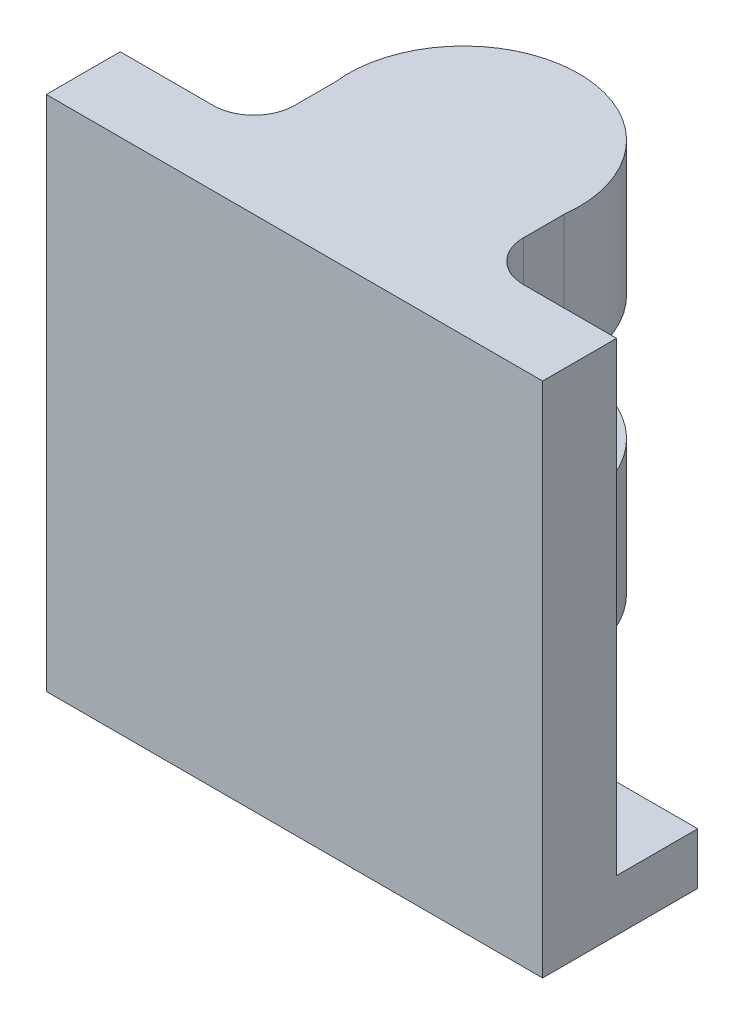
ISO-10303-21;
HEADER;
FILE_DESCRIPTION(('STEP AP214'),'2;1');
FILE_NAME('part.step','',(''),(''),'','','');
FILE_SCHEMA(('AUTOMOTIVE_DESIGN { 1 0 10303 214 1 1 1 1 }'));
ENDSEC;
DATA;
#1=APPLICATION_CONTEXT('core data for automotive mechanical design processes');
#2=APPLICATION_PROTOCOL_DEFINITION('international standard','automotive_design',2000,#1);
#3=PRODUCT_CONTEXT('',#1,'mechanical');
#4=PRODUCT('Part','Part','',(#3));
#5=PRODUCT_RELATED_PRODUCT_CATEGORY('part','',(#4));
#6=PRODUCT_DEFINITION_FORMATION('','',#4);
#7=PRODUCT_DEFINITION_CONTEXT('part definition',#1,'design');
#8=PRODUCT_DEFINITION('design','',#6,#7);
#9=PRODUCT_DEFINITION_SHAPE('','',#8);
#10=(LENGTH_UNIT() NAMED_UNIT(*) SI_UNIT(.MILLI.,.METRE.));
#11=(NAMED_UNIT(*) PLANE_ANGLE_UNIT() SI_UNIT($,.RADIAN.));
#12=(NAMED_UNIT(*) SI_UNIT($,.STERADIAN.) SOLID_ANGLE_UNIT());
#13=UNCERTAINTY_MEASURE_WITH_UNIT(LENGTH_MEASURE(1.E-05),#10,'distance_accuracy_value','');
#14=(GEOMETRIC_REPRESENTATION_CONTEXT(3) GLOBAL_UNCERTAINTY_ASSIGNED_CONTEXT((#13)) GLOBAL_UNIT_ASSIGNED_CONTEXT((#10,
#11,#12)) REPRESENTATION_CONTEXT('',''));
#15=CARTESIAN_POINT('',(0.,0.,0.));
#16=DIRECTION('',(0.,0.,1.));
#17=DIRECTION('',(1.,0.,0.));
#18=AXIS2_PLACEMENT_3D('',#15,#16,#17);
#19=CARTESIAN_POINT('',(-48.,10.,-134.85));
#20=DIRECTION('',(0.,0.,1.));
#21=DIRECTION('',(1.,0.,0.));
#22=AXIS2_PLACEMENT_3D('',#19,#20,#21);
#23=PLANE('',#22);
#24=DIRECTION('',(-1.,0.,0.));
#25=VECTOR('',#24,1.);
#26=CARTESIAN_POINT('',(-48.,24.,-134.85));
#27=LINE('',#26,#25);
#28=CARTESIAN_POINT('',(22.15,24.,-134.85));
#29=VERTEX_POINT('',#28);
#30=CARTESIAN_POINT('',(-22.15,24.,-134.85));
#31=VERTEX_POINT('',#30);
#32=EDGE_CURVE('E167',#29,#31,#27,.T.);
#33=ORIENTED_EDGE('',*,*,#32,.F.);
#34=DIRECTION('',(0.,-1.,0.));
#35=VECTOR('',#34,1.);
#36=CARTESIAN_POINT('',(22.15,100.,-134.85));
#37=LINE('',#36,#35);
#38=CARTESIAN_POINT('',(22.15,9.99999999999999,-134.85));
#39=VERTEX_POINT('',#38);
#40=EDGE_CURVE('E172',#29,#39,#37,.T.);
#41=ORIENTED_EDGE('',*,*,#40,.T.);
#42=DIRECTION('',(-1.,0.,0.));
#43=VECTOR('',#42,1.);
#44=CARTESIAN_POINT('',(-48.,10.,-134.85));
#45=LINE('',#44,#43);
#46=CARTESIAN_POINT('',(48.,10.,-134.85));
#47=VERTEX_POINT('',#46);
#48=EDGE_CURVE('E238',#47,#39,#45,.T.);
#49=ORIENTED_EDGE('',*,*,#48,.F.);
#50=DIRECTION('',(0.,-1.,0.));
#51=VECTOR('',#50,1.);
#52=CARTESIAN_POINT('',(48.,10.,-134.85));
#53=LINE('',#52,#51);
#54=CARTESIAN_POINT('',(48.,0.,-134.85));
#55=VERTEX_POINT('',#54);
#56=EDGE_CURVE('E249',#47,#55,#53,.T.);
#57=ORIENTED_EDGE('',*,*,#56,.T.);
#58=DIRECTION('',(-1.,0.,0.));
#59=VECTOR('',#58,1.);
#60=CARTESIAN_POINT('',(-48.,0.,-134.85));
#61=LINE('',#60,#59);
#62=CARTESIAN_POINT('',(-48.,0.,-134.85));
#63=VERTEX_POINT('',#62);
#64=EDGE_CURVE('E235',#55,#63,#61,.T.);
#65=ORIENTED_EDGE('',*,*,#64,.T.);
#66=DIRECTION('',(0.,-1.,0.));
#67=VECTOR('',#66,1.);
#68=CARTESIAN_POINT('',(-48.,10.,-134.85));
#69=LINE('',#68,#67);
#70=CARTESIAN_POINT('',(-48.,10.,-134.85));
#71=VERTEX_POINT('',#70);
#72=EDGE_CURVE('E240',#71,#63,#69,.T.);
#73=ORIENTED_EDGE('',*,*,#72,.F.);
#74=CARTESIAN_POINT('',(-22.15,9.99999999999999,-134.85));
#75=VERTEX_POINT('',#74);
#76=EDGE_CURVE('E237',#75,#71,#45,.T.);
#77=ORIENTED_EDGE('',*,*,#76,.F.);
#78=DIRECTION('',(0.,-1.,0.));
#79=VECTOR('',#78,1.);
#80=CARTESIAN_POINT('',(-22.15,100.,-134.85));
#81=LINE('',#80,#79);
#82=EDGE_CURVE('E175',#31,#75,#81,.T.);
#83=ORIENTED_EDGE('',*,*,#82,.F.);
#84=EDGE_LOOP('',(#33,#41,#49,#57,#65,#73,#77,#83));
#85=FACE_BOUND('',#84,.T.);
#86=ADVANCED_FACE('F47',(#85),#23,.F.);
#87=CARTESIAN_POINT('',(22.15,74.,-134.85));
#88=VERTEX_POINT('',#87);
#89=CARTESIAN_POINT('',(22.15,50.,-134.85));
#90=VERTEX_POINT('',#89);
#91=EDGE_CURVE('E183',#88,#90,#37,.T.);
#92=ORIENTED_EDGE('',*,*,#91,.T.);
#93=DIRECTION('',(-1.,0.,0.));
#94=VECTOR('',#93,1.);
#95=CARTESIAN_POINT('',(-48.,50.,-134.85));
#96=LINE('',#95,#94);
#97=CARTESIAN_POINT('',(-22.15,50.,-134.85));
#98=VERTEX_POINT('',#97);
#99=EDGE_CURVE('E161',#90,#98,#96,.T.);
#100=ORIENTED_EDGE('',*,*,#99,.T.);
#101=CARTESIAN_POINT('',(-22.15,74.,-134.85));
#102=VERTEX_POINT('',#101);
#103=EDGE_CURVE('E188',#102,#98,#81,.T.);
#104=ORIENTED_EDGE('',*,*,#103,.F.);
#105=DIRECTION('',(-1.,0.,0.));
#106=VECTOR('',#105,1.);
#107=CARTESIAN_POINT('',(-48.,74.,-134.85));
#108=LINE('',#107,#106);
#109=EDGE_CURVE('E310',#88,#102,#108,.T.);
#110=ORIENTED_EDGE('',*,*,#109,.F.);
#111=EDGE_LOOP('',(#92,#100,#104,#110));
#112=FACE_BOUND('',#111,.T.);
#113=ADVANCED_FACE('F322',(#112),#23,.F.);
#114=CARTESIAN_POINT('',(0.,10.,0.));
#115=DIRECTION('',(0.,1.,0.));
#116=DIRECTION('',(0.,0.,1.));
#117=AXIS2_PLACEMENT_3D('',#114,#115,#116);
#118=PLANE('',#117);
#119=CARTESIAN_POINT('',(30.,10.,-127.));
#120=DIRECTION('',(0.,1.,0.));
#121=DIRECTION('',(0.,0.,1.));
#122=AXIS2_PLACEMENT_3D('',#119,#120,#121);
#123=CIRCLE('',#122,1.5);
#124=CARTESIAN_POINT('',(30.,10.,-125.5));
#125=VERTEX_POINT('',#124);
#126=EDGE_CURVE('E219',#125,#125,#123,.T.);
#127=ORIENTED_EDGE('',*,*,#126,.F.);
#128=EDGE_LOOP('',(#127));
#129=FACE_BOUND('',#128,.T.);
#130=CARTESIAN_POINT('',(30.,9.99999999999999,-127.));
#131=DIRECTION('',(0.,1.,0.));
#132=DIRECTION('',(0.,0.,1.));
#133=AXIS2_PLACEMENT_3D('',#130,#131,#132);
#134=CIRCLE('',#133,7.85);
#135=CARTESIAN_POINT('',(22.15,9.99999999999999,-127.));
#136=VERTEX_POINT('',#135);
#137=CARTESIAN_POINT('',(30.,9.99999999999999,-119.15));
#138=VERTEX_POINT('',#137);
#139=EDGE_CURVE('E215',#136,#138,#134,.T.);
#140=ORIENTED_EDGE('',*,*,#139,.T.);
#141=DIRECTION('',(1.,0.,0.));
#142=VECTOR('',#141,1.);
#143=CARTESIAN_POINT('',(0.,10.,-119.15));
#144=LINE('',#143,#142);
#145=CARTESIAN_POINT('',(48.,9.99999999999999,-119.15));
#146=VERTEX_POINT('',#145);
#147=EDGE_CURVE('E206',#138,#146,#144,.T.);
#148=ORIENTED_EDGE('',*,*,#147,.T.);
#149=DIRECTION('',(0.,0.,-1.));
#150=VECTOR('',#149,1.);
#151=CARTESIAN_POINT('',(48.,10.,-134.85));
#152=LINE('',#151,#150);
#153=EDGE_CURVE('E234',#146,#47,#152,.T.);
#154=ORIENTED_EDGE('',*,*,#153,.T.);
#155=ORIENTED_EDGE('',*,*,#48,.T.);
#156=DIRECTION('',(0.,0.,1.));
#157=VECTOR('',#156,1.);
#158=CARTESIAN_POINT('',(22.15,10.,0.));
#159=LINE('',#158,#157);
#160=EDGE_CURVE('E181',#39,#136,#159,.T.);
#161=ORIENTED_EDGE('',*,*,#160,.T.);
#162=EDGE_LOOP('',(#140,#148,#154,#155,#161));
#163=FACE_BOUND('',#162,.T.);
#164=ADVANCED_FACE('F333',(#129,#163),#118,.T.);
#165=CARTESIAN_POINT('',(-30.,10.,-127.));
#166=DIRECTION('',(0.,1.,0.));
#167=DIRECTION('',(0.,0.,1.));
#168=AXIS2_PLACEMENT_3D('',#165,#166,#167);
#169=CIRCLE('',#168,1.5);
#170=CARTESIAN_POINT('',(-30.,10.,-125.5));
#171=VERTEX_POINT('',#170);
#172=EDGE_CURVE('E225',#171,#171,#169,.T.);
#173=ORIENTED_EDGE('',*,*,#172,.F.);
#174=EDGE_LOOP('',(#173));
#175=FACE_BOUND('',#174,.T.);
#176=CARTESIAN_POINT('',(-30.,9.99999999999999,-127.));
#177=DIRECTION('',(0.,1.,0.));
#178=DIRECTION('',(0.,0.,1.));
#179=AXIS2_PLACEMENT_3D('',#176,#177,#178);
#180=CIRCLE('',#179,7.85);
#181=CARTESIAN_POINT('',(-30.,10.,-119.15));
#182=VERTEX_POINT('',#181);
#183=CARTESIAN_POINT('',(-22.15,9.99999999999999,-127.));
#184=VERTEX_POINT('',#183);
#185=EDGE_CURVE('E212',#182,#184,#180,.T.);
#186=ORIENTED_EDGE('',*,*,#185,.T.);
#187=DIRECTION('',(0.,0.,-1.));
#188=VECTOR('',#187,1.);
#189=CARTESIAN_POINT('',(-22.15,10.,0.));
#190=LINE('',#189,#188);
#191=EDGE_CURVE('E202',#184,#75,#190,.T.);
#192=ORIENTED_EDGE('',*,*,#191,.T.);
#193=ORIENTED_EDGE('',*,*,#76,.T.);
#194=DIRECTION('',(0.,0.,1.));
#195=VECTOR('',#194,1.);
#196=CARTESIAN_POINT('',(-48.,10.,-134.85));
#197=LINE('',#196,#195);
#198=CARTESIAN_POINT('',(-48.,9.99999999999999,-119.15));
#199=VERTEX_POINT('',#198);
#200=EDGE_CURVE('E231',#71,#199,#197,.T.);
#201=ORIENTED_EDGE('',*,*,#200,.T.);
#202=DIRECTION('',(1.,0.,0.));
#203=VECTOR('',#202,1.);
#204=CARTESIAN_POINT('',(0.,10.,-119.15));
#205=LINE('',#204,#203);
#206=EDGE_CURVE('E209',#199,#182,#205,.T.);
#207=ORIENTED_EDGE('',*,*,#206,.T.);
#208=EDGE_LOOP('',(#186,#192,#193,#201,#207));
#209=FACE_BOUND('',#208,.T.);
#210=ADVANCED_FACE('F276',(#175,#209),#118,.T.);
#211=CARTESIAN_POINT('',(0.,0.,0.));
#212=DIRECTION('',(0.,1.,0.));
#213=DIRECTION('',(0.,0.,1.));
#214=AXIS2_PLACEMENT_3D('',#211,#212,#213);
#215=PLANE('',#214);
#216=ORIENTED_EDGE('',*,*,#64,.F.);
#217=DIRECTION('',(0.,0.,-1.));
#218=VECTOR('',#217,1.);
#219=CARTESIAN_POINT('',(48.,0.,-134.85));
#220=LINE('',#219,#218);
#221=CARTESIAN_POINT('',(48.,0.,-104.85));
#222=VERTEX_POINT('',#221);
#223=EDGE_CURVE('E244',#222,#55,#220,.T.);
#224=ORIENTED_EDGE('',*,*,#223,.F.);
#225=DIRECTION('',(1.,0.,0.));
#226=VECTOR('',#225,1.);
#227=CARTESIAN_POINT('',(-48.,0.,-104.85));
#228=LINE('',#227,#226);
#229=CARTESIAN_POINT('',(-48.,0.,-104.85));
#230=VERTEX_POINT('',#229);
#231=EDGE_CURVE('E242',#230,#222,#228,.T.);
#232=ORIENTED_EDGE('',*,*,#231,.F.);
#233=DIRECTION('',(0.,0.,1.));
#234=VECTOR('',#233,1.);
#235=CARTESIAN_POINT('',(-48.,0.,-134.85));
#236=LINE('',#235,#234);
#237=EDGE_CURVE('E228',#63,#230,#236,.T.);
#238=ORIENTED_EDGE('',*,*,#237,.F.);
#239=EDGE_LOOP('',(#216,#224,#232,#238));
#240=FACE_BOUND('',#239,.T.);
#241=CARTESIAN_POINT('',(-30.,0.,-127.));
#242=DIRECTION('',(0.,1.,0.));
#243=DIRECTION('',(0.,0.,1.));
#244=AXIS2_PLACEMENT_3D('',#241,#242,#243);
#245=CIRCLE('',#244,1.5);
#246=CARTESIAN_POINT('',(-30.,0.,-125.5));
#247=VERTEX_POINT('',#246);
#248=EDGE_CURVE('E222',#247,#247,#245,.T.);
#249=ORIENTED_EDGE('',*,*,#248,.T.);
#250=EDGE_LOOP('',(#249));
#251=FACE_BOUND('',#250,.T.);
#252=CARTESIAN_POINT('',(30.,0.,-127.));
#253=DIRECTION('',(0.,1.,0.));
#254=DIRECTION('',(0.,0.,1.));
#255=AXIS2_PLACEMENT_3D('',#252,#253,#254);
#256=CIRCLE('',#255,1.5);
#257=CARTESIAN_POINT('',(30.,0.,-125.5));
#258=VERTEX_POINT('',#257);
#259=EDGE_CURVE('E218',#258,#258,#256,.T.);
#260=ORIENTED_EDGE('',*,*,#259,.T.);
#261=EDGE_LOOP('',(#260));
#262=FACE_BOUND('',#261,.T.);
#263=ADVANCED_FACE('F265',(#240,#251,#262),#215,.F.);
#264=CARTESIAN_POINT('',(-48.,10.,-134.85));
#265=DIRECTION('',(1.,0.,0.));
#266=DIRECTION('',(0.,0.,-1.));
#267=AXIS2_PLACEMENT_3D('',#264,#265,#266);
#268=PLANE('',#267);
#269=DIRECTION('',(0.,-1.,0.));
#270=VECTOR('',#269,1.);
#271=CARTESIAN_POINT('',(-48.,10.,-104.85));
#272=LINE('',#271,#270);
#273=CARTESIAN_POINT('',(-48.,100.,-104.85));
#274=VERTEX_POINT('',#273);
#275=EDGE_CURVE('E13',#274,#230,#272,.T.);
#276=ORIENTED_EDGE('',*,*,#275,.F.);
#277=DIRECTION('',(0.,0.,1.));
#278=VECTOR('',#277,1.);
#279=CARTESIAN_POINT('',(-48.,100.,-119.15));
#280=LINE('',#279,#278);
#281=CARTESIAN_POINT('',(-48.,100.,-119.15));
#282=VERTEX_POINT('',#281);
#283=EDGE_CURVE('E307',#282,#274,#280,.T.);
#284=ORIENTED_EDGE('',*,*,#283,.F.);
#285=DIRECTION('',(0.,-1.,0.));
#286=VECTOR('',#285,1.);
#287=CARTESIAN_POINT('',(-48.,100.,-119.15));
#288=LINE('',#287,#286);
#289=EDGE_CURVE('E274',#282,#199,#288,.T.);
#290=ORIENTED_EDGE('',*,*,#289,.T.);
#291=ORIENTED_EDGE('',*,*,#200,.F.);
#292=ORIENTED_EDGE('',*,*,#72,.T.);
#293=ORIENTED_EDGE('',*,*,#237,.T.);
#294=EDGE_LOOP('',(#276,#284,#290,#291,#292,#293));
#295=FACE_BOUND('',#294,.T.);
#296=ADVANCED_FACE('F49',(#295),#268,.F.);
#297=CARTESIAN_POINT('',(-48.,10.,-104.85));
#298=DIRECTION('',(0.,0.,-1.));
#299=DIRECTION('',(-1.,0.,0.));
#300=AXIS2_PLACEMENT_3D('',#297,#298,#299);
#301=PLANE('',#300);
#302=DIRECTION('',(0.,-1.,0.));
#303=VECTOR('',#302,1.);
#304=CARTESIAN_POINT('',(48.,10.,-104.85));
#305=LINE('',#304,#303);
#306=CARTESIAN_POINT('',(48.,100.,-104.85));
#307=VERTEX_POINT('',#306);
#308=EDGE_CURVE('E55',#307,#222,#305,.T.);
#309=ORIENTED_EDGE('',*,*,#308,.F.);
#310=DIRECTION('',(1.,0.,0.));
#311=VECTOR('',#310,1.);
#312=CARTESIAN_POINT('',(48.,100.,-104.85));
#313=LINE('',#312,#311);
#314=EDGE_CURVE('E305',#274,#307,#313,.T.);
#315=ORIENTED_EDGE('',*,*,#314,.F.);
#316=ORIENTED_EDGE('',*,*,#275,.T.);
#317=ORIENTED_EDGE('',*,*,#231,.T.);
#318=EDGE_LOOP('',(#309,#315,#316,#317));
#319=FACE_BOUND('',#318,.T.);
#320=ADVANCED_FACE('F357',(#319),#301,.F.);
#321=CARTESIAN_POINT('',(48.,10.,-134.85));
#322=DIRECTION('',(-1.,0.,0.));
#323=DIRECTION('',(0.,0.,1.));
#324=AXIS2_PLACEMENT_3D('',#321,#322,#323);
#325=PLANE('',#324);
#326=ORIENTED_EDGE('',*,*,#223,.T.);
#327=ORIENTED_EDGE('',*,*,#56,.F.);
#328=ORIENTED_EDGE('',*,*,#153,.F.);
#329=DIRECTION('',(0.,-1.,0.));
#330=VECTOR('',#329,1.);
#331=CARTESIAN_POINT('',(48.,100.,-119.15));
#332=LINE('',#331,#330);
#333=CARTESIAN_POINT('',(48.,100.,-119.15));
#334=VERTEX_POINT('',#333);
#335=EDGE_CURVE('E198',#334,#146,#332,.T.);
#336=ORIENTED_EDGE('',*,*,#335,.F.);
#337=DIRECTION('',(0.,0.,-1.));
#338=VECTOR('',#337,1.);
#339=CARTESIAN_POINT('',(48.,100.,-119.15));
#340=LINE('',#339,#338);
#341=EDGE_CURVE('E259',#307,#334,#340,.T.);
#342=ORIENTED_EDGE('',*,*,#341,.F.);
#343=ORIENTED_EDGE('',*,*,#308,.T.);
#344=EDGE_LOOP('',(#326,#327,#328,#336,#342,#343));
#345=FACE_BOUND('',#344,.T.);
#346=ADVANCED_FACE('F256',(#345),#325,.F.);
#347=CARTESIAN_POINT('',(-30.,10.,-127.));
#348=DIRECTION('',(0.,-1.,0.));
#349=DIRECTION('',(0.,0.,-1.));
#350=AXIS2_PLACEMENT_3D('',#347,#348,#349);
#351=CYLINDRICAL_SURFACE('',#350,1.5);
#352=ORIENTED_EDGE('',*,*,#172,.T.);
#353=EDGE_LOOP('',(#352));
#354=FACE_BOUND('',#353,.T.);
#355=ORIENTED_EDGE('',*,*,#248,.F.);
#356=EDGE_LOOP('',(#355));
#357=FACE_BOUND('',#356,.T.);
#358=ADVANCED_FACE('F345',(#354,#357),#351,.F.);
#359=CARTESIAN_POINT('',(30.,10.,-127.));
#360=DIRECTION('',(0.,-1.,0.));
#361=DIRECTION('',(0.,0.,-1.));
#362=AXIS2_PLACEMENT_3D('',#359,#360,#361);
#363=CYLINDRICAL_SURFACE('',#362,1.5);
#364=ORIENTED_EDGE('',*,*,#126,.T.);
#365=EDGE_LOOP('',(#364));
#366=FACE_BOUND('',#365,.T.);
#367=ORIENTED_EDGE('',*,*,#259,.F.);
#368=EDGE_LOOP('',(#367));
#369=FACE_BOUND('',#368,.T.);
#370=ADVANCED_FACE('F338',(#366,#369),#363,.F.);
#371=CARTESIAN_POINT('',(30.,100.,-119.15));
#372=DIRECTION('',(0.,0.,1.));
#373=DIRECTION('',(1.,0.,0.));
#374=AXIS2_PLACEMENT_3D('',#371,#372,#373);
#375=PLANE('',#374);
#376=ORIENTED_EDGE('',*,*,#147,.F.);
#377=DIRECTION('',(0.,-1.,0.));
#378=VECTOR('',#377,1.);
#379=CARTESIAN_POINT('',(30.,100.,-119.15));
#380=LINE('',#379,#378);
#381=CARTESIAN_POINT('',(30.,100.,-119.15));
#382=VERTEX_POINT('',#381);
#383=EDGE_CURVE('E193',#382,#138,#380,.T.);
#384=ORIENTED_EDGE('',*,*,#383,.F.);
#385=DIRECTION('',(-1.,0.,0.));
#386=VECTOR('',#385,1.);
#387=CARTESIAN_POINT('',(30.,100.,-119.15));
#388=LINE('',#387,#386);
#389=EDGE_CURVE('E302',#334,#382,#388,.T.);
#390=ORIENTED_EDGE('',*,*,#389,.F.);
#391=ORIENTED_EDGE('',*,*,#335,.T.);
#392=EDGE_LOOP('',(#376,#384,#390,#391));
#393=FACE_BOUND('',#392,.T.);
#394=ADVANCED_FACE('F336',(#393),#375,.F.);
#395=CARTESIAN_POINT('',(30.,100.,-127.));
#396=DIRECTION('',(0.,-1.,0.));
#397=DIRECTION('',(0.,0.,-1.));
#398=AXIS2_PLACEMENT_3D('',#395,#396,#397);
#399=CYLINDRICAL_SURFACE('',#398,7.85);
#400=ORIENTED_EDGE('',*,*,#139,.F.);
#401=DIRECTION('',(0.,-1.,0.));
#402=VECTOR('',#401,1.);
#403=CARTESIAN_POINT('',(22.15,100.,-127.));
#404=LINE('',#403,#402);
#405=CARTESIAN_POINT('',(22.15,100.,-127.));
#406=VERTEX_POINT('',#405);
#407=EDGE_CURVE('E191',#406,#136,#404,.T.);
#408=ORIENTED_EDGE('',*,*,#407,.F.);
#409=CARTESIAN_POINT('',(30.,100.,-127.));
#410=DIRECTION('',(0.,-1.,0.));
#411=DIRECTION('',(0.,0.,1.));
#412=AXIS2_PLACEMENT_3D('',#409,#410,#411);
#413=CIRCLE('',#412,7.85);
#414=EDGE_CURVE('E300',#382,#406,#413,.T.);
#415=ORIENTED_EDGE('',*,*,#414,.F.);
#416=ORIENTED_EDGE('',*,*,#383,.T.);
#417=EDGE_LOOP('',(#400,#408,#415,#416));
#418=FACE_BOUND('',#417,.T.);
#419=ADVANCED_FACE('F331',(#418),#399,.F.);
#420=CARTESIAN_POINT('',(22.15,100.,-127.));
#421=DIRECTION('',(-1.,0.,0.));
#422=DIRECTION('',(0.,0.,1.));
#423=AXIS2_PLACEMENT_3D('',#420,#421,#422);
#424=PLANE('',#423);
#425=ORIENTED_EDGE('',*,*,#407,.T.);
#426=ORIENTED_EDGE('',*,*,#160,.F.);
#427=ORIENTED_EDGE('',*,*,#40,.F.);
#428=DIRECTION('',(0.,1.,0.));
#429=VECTOR('',#428,1.);
#430=CARTESIAN_POINT('',(22.15,24.,-134.85));
#431=LINE('',#430,#429);
#432=EDGE_CURVE('E153',#29,#90,#431,.T.);
#433=ORIENTED_EDGE('',*,*,#432,.T.);
#434=ORIENTED_EDGE('',*,*,#91,.F.);
#435=CARTESIAN_POINT('',(22.15,100.,-134.85));
#436=VERTEX_POINT('',#435);
#437=EDGE_CURVE('E186',#436,#88,#37,.T.);
#438=ORIENTED_EDGE('',*,*,#437,.F.);
#439=DIRECTION('',(0.,0.,-1.));
#440=VECTOR('',#439,1.);
#441=CARTESIAN_POINT('',(22.15,100.,-127.));
#442=LINE('',#441,#440);
#443=EDGE_CURVE('E297',#406,#436,#442,.T.);
#444=ORIENTED_EDGE('',*,*,#443,.F.);
#445=EDGE_LOOP('',(#425,#426,#427,#433,#434,#438,#444));
#446=FACE_BOUND('',#445,.T.);
#447=ADVANCED_FACE('F179',(#446),#424,.F.);
#448=CARTESIAN_POINT('',(-22.15,100.,-127.));
#449=DIRECTION('',(1.,0.,0.));
#450=DIRECTION('',(0.,0.,-1.));
#451=AXIS2_PLACEMENT_3D('',#448,#449,#450);
#452=PLANE('',#451);
#453=ORIENTED_EDGE('',*,*,#103,.T.);
#454=DIRECTION('',(0.,1.,0.));
#455=VECTOR('',#454,1.);
#456=CARTESIAN_POINT('',(-22.15,24.,-134.85));
#457=LINE('',#456,#455);
#458=EDGE_CURVE('E162',#31,#98,#457,.T.);
#459=ORIENTED_EDGE('',*,*,#458,.F.);
#460=ORIENTED_EDGE('',*,*,#82,.T.);
#461=ORIENTED_EDGE('',*,*,#191,.F.);
#462=DIRECTION('',(0.,-1.,0.));
#463=VECTOR('',#462,1.);
#464=CARTESIAN_POINT('',(-22.15,100.,-127.));
#465=LINE('',#464,#463);
#466=CARTESIAN_POINT('',(-22.15,100.,-127.));
#467=VERTEX_POINT('',#466);
#468=EDGE_CURVE('E284',#467,#184,#465,.T.);
#469=ORIENTED_EDGE('',*,*,#468,.F.);
#470=DIRECTION('',(0.,0.,1.));
#471=VECTOR('',#470,1.);
#472=CARTESIAN_POINT('',(-22.15,100.,-127.));
#473=LINE('',#472,#471);
#474=CARTESIAN_POINT('',(-22.15,100.,-134.85));
#475=VERTEX_POINT('',#474);
#476=EDGE_CURVE('E295',#475,#467,#473,.T.);
#477=ORIENTED_EDGE('',*,*,#476,.F.);
#478=EDGE_CURVE('E184',#475,#102,#81,.T.);
#479=ORIENTED_EDGE('',*,*,#478,.T.);
#480=EDGE_LOOP('',(#453,#459,#460,#461,#469,#477,#479));
#481=FACE_BOUND('',#480,.T.);
#482=ADVANCED_FACE('F282',(#481),#452,.F.);
#483=CARTESIAN_POINT('',(-30.,100.,-127.));
#484=DIRECTION('',(0.,-1.,0.));
#485=DIRECTION('',(0.,0.,-1.));
#486=AXIS2_PLACEMENT_3D('',#483,#484,#485);
#487=CYLINDRICAL_SURFACE('',#486,7.85);
#488=ORIENTED_EDGE('',*,*,#185,.F.);
#489=DIRECTION('',(0.,-1.,0.));
#490=VECTOR('',#489,1.);
#491=CARTESIAN_POINT('',(-30.,100.,-119.15));
#492=LINE('',#491,#490);
#493=CARTESIAN_POINT('',(-30.,100.,-119.15));
#494=VERTEX_POINT('',#493);
#495=EDGE_CURVE('E286',#494,#182,#492,.T.);
#496=ORIENTED_EDGE('',*,*,#495,.F.);
#497=CARTESIAN_POINT('',(-30.,100.,-127.));
#498=DIRECTION('',(0.,-1.,0.));
#499=DIRECTION('',(0.,0.,-1.));
#500=AXIS2_PLACEMENT_3D('',#497,#498,#499);
#501=CIRCLE('',#500,7.85);
#502=EDGE_CURVE('E293',#467,#494,#501,.T.);
#503=ORIENTED_EDGE('',*,*,#502,.F.);
#504=ORIENTED_EDGE('',*,*,#468,.T.);
#505=EDGE_LOOP('',(#488,#496,#503,#504));
#506=FACE_BOUND('',#505,.T.);
#507=ADVANCED_FACE('F430',(#506),#487,.F.);
#508=CARTESIAN_POINT('',(-30.,100.,-119.15));
#509=DIRECTION('',(0.,0.,1.));
#510=DIRECTION('',(1.,0.,0.));
#511=AXIS2_PLACEMENT_3D('',#508,#509,#510);
#512=PLANE('',#511);
#513=ORIENTED_EDGE('',*,*,#206,.F.);
#514=ORIENTED_EDGE('',*,*,#289,.F.);
#515=DIRECTION('',(-1.,0.,0.));
#516=VECTOR('',#515,1.);
#517=CARTESIAN_POINT('',(-30.,100.,-119.15));
#518=LINE('',#517,#516);
#519=EDGE_CURVE('E291',#494,#282,#518,.T.);
#520=ORIENTED_EDGE('',*,*,#519,.F.);
#521=ORIENTED_EDGE('',*,*,#495,.T.);
#522=EDGE_LOOP('',(#513,#514,#520,#521));
#523=FACE_BOUND('',#522,.T.);
#524=ADVANCED_FACE('F425',(#523),#512,.F.);
#525=CARTESIAN_POINT('',(30.,100.,-127.));
#526=DIRECTION('',(0.,1.,0.));
#527=DIRECTION('',(0.,0.,1.));
#528=AXIS2_PLACEMENT_3D('',#525,#526,#527);
#529=PLANE('',#528);
#530=ORIENTED_EDGE('',*,*,#314,.T.);
#531=ORIENTED_EDGE('',*,*,#341,.T.);
#532=ORIENTED_EDGE('',*,*,#389,.T.);
#533=ORIENTED_EDGE('',*,*,#414,.T.);
#534=ORIENTED_EDGE('',*,*,#443,.T.);
#535=CARTESIAN_POINT('',(0.,100.,-137.53755));
#536=DIRECTION('',(0.,1.,0.));
#537=DIRECTION('',(0.,0.,1.));
#538=AXIS2_PLACEMENT_3D('',#535,#536,#537);
#539=CIRCLE('',#538,22.31245);
#540=EDGE_CURVE('E177',#436,#475,#539,.T.);
#541=ORIENTED_EDGE('',*,*,#540,.T.);
#542=ORIENTED_EDGE('',*,*,#476,.T.);
#543=ORIENTED_EDGE('',*,*,#502,.T.);
#544=ORIENTED_EDGE('',*,*,#519,.T.);
#545=ORIENTED_EDGE('',*,*,#283,.T.);
#546=EDGE_LOOP('',(#530,#531,#532,#533,#534,#541,#542,#543,#544,#545));
#547=FACE_BOUND('',#546,.T.);
#548=ADVANCED_FACE('F326',(#547),#529,.T.);
#549=CARTESIAN_POINT('',(0.,74.,-137.53755));
#550=DIRECTION('',(0.,1.,0.));
#551=DIRECTION('',(0.,0.,1.));
#552=AXIS2_PLACEMENT_3D('',#549,#550,#551);
#553=PLANE('',#552);
#554=CARTESIAN_POINT('',(0.,74.,-137.53755));
#555=DIRECTION('',(0.,1.,0.));
#556=DIRECTION('',(0.,0.,1.));
#557=AXIS2_PLACEMENT_3D('',#554,#555,#556);
#558=CIRCLE('',#557,22.31245);
#559=EDGE_CURVE('E70',#88,#102,#558,.T.);
#560=ORIENTED_EDGE('',*,*,#559,.F.);
#561=ORIENTED_EDGE('',*,*,#109,.T.);
#562=EDGE_LOOP('',(#560,#561));
#563=FACE_BOUND('',#562,.T.);
#564=ADVANCED_FACE('F443',(#563),#553,.F.);
#565=CARTESIAN_POINT('',(0.,74.,-137.53755));
#566=DIRECTION('',(0.,1.,0.));
#567=DIRECTION('',(0.,0.,1.));
#568=AXIS2_PLACEMENT_3D('',#565,#566,#567);
#569=CYLINDRICAL_SURFACE('',#568,22.31245);
#570=ORIENTED_EDGE('',*,*,#540,.F.);
#571=ORIENTED_EDGE('',*,*,#437,.T.);
#572=ORIENTED_EDGE('',*,*,#559,.T.);
#573=ORIENTED_EDGE('',*,*,#478,.F.);
#574=EDGE_LOOP('',(#570,#571,#572,#573));
#575=FACE_BOUND('',#574,.T.);
#576=ADVANCED_FACE('F324',(#575),#569,.T.);
#577=CARTESIAN_POINT('',(0.,24.,-137.53755));
#578=DIRECTION('',(0.,1.,0.));
#579=DIRECTION('',(0.,0.,1.));
#580=AXIS2_PLACEMENT_3D('',#577,#578,#579);
#581=PLANE('',#580);
#582=CARTESIAN_POINT('',(0.,24.,-137.53755));
#583=DIRECTION('',(0.,1.,0.));
#584=DIRECTION('',(0.,0.,1.));
#585=AXIS2_PLACEMENT_3D('',#582,#583,#584);
#586=CIRCLE('',#585,22.31245);
#587=EDGE_CURVE('E62',#29,#31,#586,.T.);
#588=ORIENTED_EDGE('',*,*,#587,.F.);
#589=ORIENTED_EDGE('',*,*,#32,.T.);
#590=EDGE_LOOP('',(#588,#589));
#591=FACE_BOUND('',#590,.T.);
#592=ADVANCED_FACE('F166',(#591),#581,.F.);
#593=CARTESIAN_POINT('',(0.,50.,-137.53755));
#594=DIRECTION('',(0.,1.,0.));
#595=DIRECTION('',(0.,0.,1.));
#596=AXIS2_PLACEMENT_3D('',#593,#594,#595);
#597=PLANE('',#596);
#598=ORIENTED_EDGE('',*,*,#99,.F.);
#599=CARTESIAN_POINT('',(0.,50.,-137.53755));
#600=DIRECTION('',(0.,1.,0.));
#601=DIRECTION('',(0.,0.,1.));
#602=AXIS2_PLACEMENT_3D('',#599,#600,#601);
#603=CIRCLE('',#602,22.31245);
#604=EDGE_CURVE('E156',#90,#98,#603,.T.);
#605=ORIENTED_EDGE('',*,*,#604,.T.);
#606=EDGE_LOOP('',(#598,#605));
#607=FACE_BOUND('',#606,.T.);
#608=ADVANCED_FACE('F319',(#607),#597,.T.);
#609=CARTESIAN_POINT('',(0.,24.,-137.53755));
#610=DIRECTION('',(0.,1.,0.));
#611=DIRECTION('',(0.,0.,1.));
#612=AXIS2_PLACEMENT_3D('',#609,#610,#611);
#613=CYLINDRICAL_SURFACE('',#612,22.31245);
#614=ORIENTED_EDGE('',*,*,#604,.F.);
#615=ORIENTED_EDGE('',*,*,#432,.F.);
#616=ORIENTED_EDGE('',*,*,#587,.T.);
#617=ORIENTED_EDGE('',*,*,#458,.T.);
#618=EDGE_LOOP('',(#614,#615,#616,#617));
#619=FACE_BOUND('',#618,.T.);
#620=ADVANCED_FACE('F154',(#619),#613,.T.);
#621=CLOSED_SHELL('',(#86,#113,#164,#210,#263,#296,#320,#346,#358,#370,#394,#419,#447,#482,#507,
#524,#548,#564,#576,#592,#608,#620));
#622=MANIFOLD_SOLID_BREP('B2',#621);
#623=ADVANCED_BREP_SHAPE_REPRESENTATION('',(#18,#622),#14);
#624=SHAPE_DEFINITION_REPRESENTATION(#9,#623);
ENDSEC;
END-ISO-10303-21;
